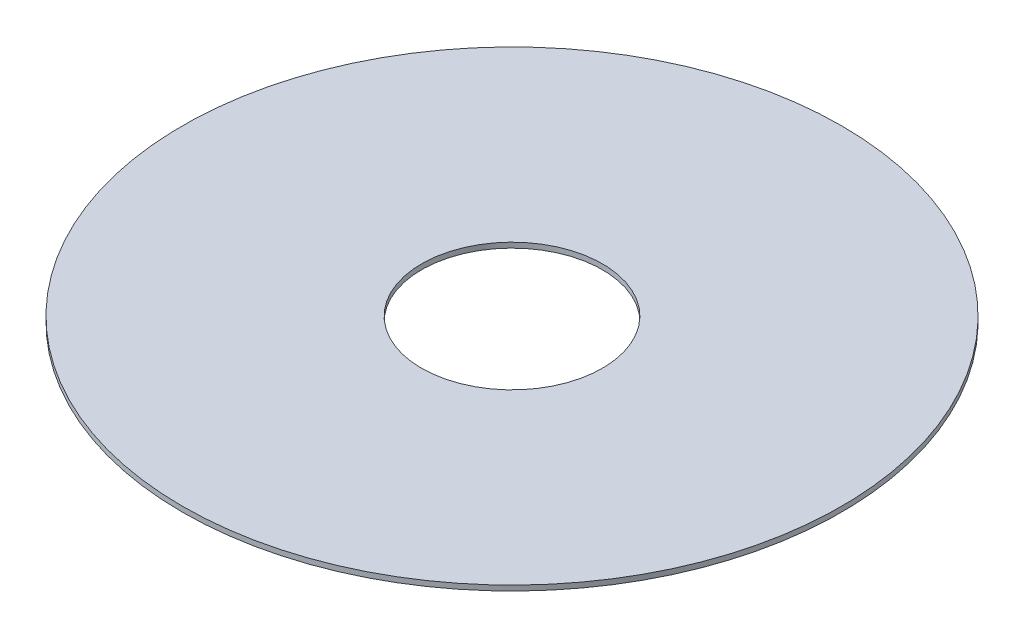
ISO-10303-21;
HEADER;
FILE_DESCRIPTION(('STEP AP214'),'2;1');
FILE_NAME('part.step','',(''),(''),'','','');
FILE_SCHEMA(('AUTOMOTIVE_DESIGN { 1 0 10303 214 1 1 1 1 }'));
ENDSEC;
DATA;
#1=APPLICATION_CONTEXT('core data for automotive mechanical design processes');
#2=APPLICATION_PROTOCOL_DEFINITION('international standard','automotive_design',2000,#1);
#3=PRODUCT_CONTEXT('',#1,'mechanical');
#4=PRODUCT('Part','Part','',(#3));
#5=PRODUCT_RELATED_PRODUCT_CATEGORY('part','',(#4));
#6=PRODUCT_DEFINITION_FORMATION('','',#4);
#7=PRODUCT_DEFINITION_CONTEXT('part definition',#1,'design');
#8=PRODUCT_DEFINITION('design','',#6,#7);
#9=PRODUCT_DEFINITION_SHAPE('','',#8);
#10=(LENGTH_UNIT() NAMED_UNIT(*) SI_UNIT(.MILLI.,.METRE.));
#11=(NAMED_UNIT(*) PLANE_ANGLE_UNIT() SI_UNIT($,.RADIAN.));
#12=(NAMED_UNIT(*) SI_UNIT($,.STERADIAN.) SOLID_ANGLE_UNIT());
#13=UNCERTAINTY_MEASURE_WITH_UNIT(LENGTH_MEASURE(1.E-05),#10,'distance_accuracy_value','');
#14=(GEOMETRIC_REPRESENTATION_CONTEXT(3) GLOBAL_UNCERTAINTY_ASSIGNED_CONTEXT((#13)) GLOBAL_UNIT_ASSIGNED_CONTEXT((#10,
#11,#12)) REPRESENTATION_CONTEXT('',''));
#15=CARTESIAN_POINT('',(0.,0.,0.));
#16=DIRECTION('',(0.,0.,1.));
#17=DIRECTION('',(1.,0.,0.));
#18=AXIS2_PLACEMENT_3D('',#15,#16,#17);
#19=CARTESIAN_POINT('',(0.,-0.1,0.));
#20=DIRECTION('',(0.,1.,0.));
#21=DIRECTION('',(0.,0.,1.));
#22=AXIS2_PLACEMENT_3D('',#19,#20,#21);
#23=CYLINDRICAL_SURFACE('',#22,12.75);
#24=CARTESIAN_POINT('',(0.,-0.1,0.));
#25=DIRECTION('',(0.,1.,0.));
#26=DIRECTION('',(0.,0.,1.));
#27=AXIS2_PLACEMENT_3D('',#24,#25,#26);
#28=CIRCLE('',#27,12.75);
#29=CARTESIAN_POINT('',(0.,-0.1,12.75));
#30=VERTEX_POINT('',#29);
#31=EDGE_CURVE('E10',#30,#30,#28,.T.);
#32=ORIENTED_EDGE('',*,*,#31,.T.);
#33=EDGE_LOOP('',(#32));
#34=FACE_BOUND('',#33,.T.);
#35=CARTESIAN_POINT('',(0.,0.1,0.));
#36=DIRECTION('',(0.,1.,0.));
#37=DIRECTION('',(0.,0.,1.));
#38=AXIS2_PLACEMENT_3D('',#35,#36,#37);
#39=CIRCLE('',#38,12.75);
#40=CARTESIAN_POINT('',(0.,0.1,12.75));
#41=VERTEX_POINT('',#40);
#42=EDGE_CURVE('E45',#41,#41,#39,.T.);
#43=ORIENTED_EDGE('',*,*,#42,.F.);
#44=EDGE_LOOP('',(#43));
#45=FACE_BOUND('',#44,.T.);
#46=ADVANCED_FACE('F35',(#34,#45),#23,.T.);
#47=CARTESIAN_POINT('',(0.,-0.1,0.));
#48=DIRECTION('',(0.,1.,0.));
#49=DIRECTION('',(0.,0.,1.));
#50=AXIS2_PLACEMENT_3D('',#47,#48,#49);
#51=PLANE('',#50);
#52=CARTESIAN_POINT('',(0.,-0.1,0.));
#53=DIRECTION('',(0.,1.,0.));
#54=DIRECTION('',(0.,0.,1.));
#55=AXIS2_PLACEMENT_3D('',#52,#53,#54);
#56=CIRCLE('',#55,3.5);
#57=CARTESIAN_POINT('',(0.,-0.1,3.5));
#58=VERTEX_POINT('',#57);
#59=EDGE_CURVE('E41',#58,#58,#56,.T.);
#60=ORIENTED_EDGE('',*,*,#59,.T.);
#61=EDGE_LOOP('',(#60));
#62=FACE_BOUND('',#61,.T.);
#63=ORIENTED_EDGE('',*,*,#31,.F.);
#64=EDGE_LOOP('',(#63));
#65=FACE_BOUND('',#64,.T.);
#66=ADVANCED_FACE('F64',(#62,#65),#51,.F.);
#67=CARTESIAN_POINT('',(0.,-0.1,0.));
#68=DIRECTION('',(0.,1.,0.));
#69=DIRECTION('',(0.,0.,1.));
#70=AXIS2_PLACEMENT_3D('',#67,#68,#69);
#71=CYLINDRICAL_SURFACE('',#70,3.5);
#72=ORIENTED_EDGE('',*,*,#59,.F.);
#73=EDGE_LOOP('',(#72));
#74=FACE_BOUND('',#73,.T.);
#75=CARTESIAN_POINT('',(0.,0.1,0.));
#76=DIRECTION('',(0.,1.,0.));
#77=DIRECTION('',(0.,0.,1.));
#78=AXIS2_PLACEMENT_3D('',#75,#76,#77);
#79=CIRCLE('',#78,3.5);
#80=CARTESIAN_POINT('',(0.,0.1,3.5));
#81=VERTEX_POINT('',#80);
#82=EDGE_CURVE('E49',#81,#81,#79,.T.);
#83=ORIENTED_EDGE('',*,*,#82,.T.);
#84=EDGE_LOOP('',(#83));
#85=FACE_BOUND('',#84,.T.);
#86=ADVANCED_FACE('F55',(#74,#85),#71,.F.);
#87=CARTESIAN_POINT('',(0.,0.1,0.));
#88=DIRECTION('',(0.,1.,0.));
#89=DIRECTION('',(0.,0.,1.));
#90=AXIS2_PLACEMENT_3D('',#87,#88,#89);
#91=PLANE('',#90);
#92=ORIENTED_EDGE('',*,*,#42,.T.);
#93=EDGE_LOOP('',(#92));
#94=FACE_BOUND('',#93,.T.);
#95=ORIENTED_EDGE('',*,*,#82,.F.);
#96=EDGE_LOOP('',(#95));
#97=FACE_BOUND('',#96,.T.);
#98=ADVANCED_FACE('F57',(#94,#97),#91,.T.);
#99=CLOSED_SHELL('',(#46,#66,#86,#98));
#100=MANIFOLD_SOLID_BREP('B2',#99);
#101=ADVANCED_BREP_SHAPE_REPRESENTATION('',(#18,#100),#14);
#102=SHAPE_DEFINITION_REPRESENTATION(#9,#101);
ENDSEC;
END-ISO-10303-21;
